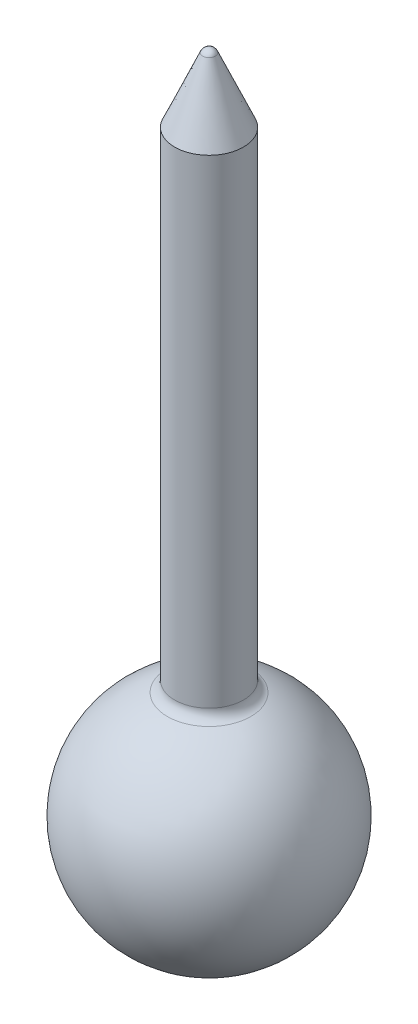
ISO-10303-21;
HEADER;
FILE_DESCRIPTION(('STEP AP214'),'2;1');
FILE_NAME('part.step','',(''),(''),'','','');
FILE_SCHEMA(('AUTOMOTIVE_DESIGN { 1 0 10303 214 1 1 1 1 }'));
ENDSEC;
DATA;
#1=APPLICATION_CONTEXT('core data for automotive mechanical design processes');
#2=APPLICATION_PROTOCOL_DEFINITION('international standard','automotive_design',2000,#1);
#3=PRODUCT_CONTEXT('',#1,'mechanical');
#4=PRODUCT('Part','Part','',(#3));
#5=PRODUCT_RELATED_PRODUCT_CATEGORY('part','',(#4));
#6=PRODUCT_DEFINITION_FORMATION('','',#4);
#7=PRODUCT_DEFINITION_CONTEXT('part definition',#1,'design');
#8=PRODUCT_DEFINITION('design','',#6,#7);
#9=PRODUCT_DEFINITION_SHAPE('','',#8);
#10=(LENGTH_UNIT() NAMED_UNIT(*) SI_UNIT(.MILLI.,.METRE.));
#11=(NAMED_UNIT(*) PLANE_ANGLE_UNIT() SI_UNIT($,.RADIAN.));
#12=(NAMED_UNIT(*) SI_UNIT($,.STERADIAN.) SOLID_ANGLE_UNIT());
#13=UNCERTAINTY_MEASURE_WITH_UNIT(LENGTH_MEASURE(1.E-05),#10,'distance_accuracy_value','');
#14=(GEOMETRIC_REPRESENTATION_CONTEXT(3) GLOBAL_UNCERTAINTY_ASSIGNED_CONTEXT((#13)) GLOBAL_UNIT_ASSIGNED_CONTEXT((#10,
#11,#12)) REPRESENTATION_CONTEXT('',''));
#15=CARTESIAN_POINT('',(0.,0.,0.));
#16=DIRECTION('',(0.,0.,1.));
#17=DIRECTION('',(1.,0.,0.));
#18=AXIS2_PLACEMENT_3D('',#15,#16,#17);
#19=CARTESIAN_POINT('',(0.,5.,0.));
#20=DIRECTION('',(0.,-1.,0.));
#21=DIRECTION('',(-1.,0.,0.));
#22=AXIS2_PLACEMENT_3D('',#19,#20,#21);
#23=SPHERICAL_SURFACE('',#22,5.);
#24=CARTESIAN_POINT('',(0.,9.657704893618,0.));
#25=DIRECTION('',(0.,-1.,0.));
#26=DIRECTION('',(0.,0.,-1.));
#27=AXIS2_PLACEMENT_3D('',#24,#25,#26);
#28=CIRCLE('',#27,1.81818181818182);
#29=CARTESIAN_POINT('',(0.,9.657704893618,-1.81818181818182));
#30=VERTEX_POINT('',#29);
#31=EDGE_CURVE('E56',#30,#30,#28,.T.);
#32=ORIENTED_EDGE('',*,*,#31,.T.);
#33=EDGE_LOOP('',(#32));
#34=FACE_BOUND('',#33,.T.);
#35=ADVANCED_FACE('F30',(#34),#23,.T.);
#36=CARTESIAN_POINT('',(0.,33.7,0.));
#37=DIRECTION('',(0.,-1.,0.));
#38=DIRECTION('',(1.,0.,0.));
#39=AXIS2_PLACEMENT_3D('',#36,#37,#38);
#40=SPHERICAL_SURFACE('',#39,0.300000000000001);
#41=CARTESIAN_POINT('',(0.,33.8195323221598,0.));
#42=DIRECTION('',(0.,-1.,0.));
#43=DIRECTION('',(0.,0.,-1.));
#44=AXIS2_PLACEMENT_3D('',#41,#42,#43);
#45=CIRCLE('',#44,0.275158179887652);
#46=CARTESIAN_POINT('',(0.,33.8195323221598,-0.275158179887652));
#47=VERTEX_POINT('',#46);
#48=EDGE_CURVE('E45',#47,#47,#45,.T.);
#49=ORIENTED_EDGE('',*,*,#48,.F.);
#50=EDGE_LOOP('',(#49));
#51=FACE_BOUND('',#50,.T.);
#52=ADVANCED_FACE('F74',(#51),#40,.T.);
#53=CARTESIAN_POINT('',(0.,31.,0.));
#54=DIRECTION('',(0.,-1.,0.));
#55=DIRECTION('',(0.,0.,-1.));
#56=AXIS2_PLACEMENT_3D('',#53,#54,#55);
#57=CONICAL_SURFACE('',#56,1.5,0.409816548258795);
#58=ORIENTED_EDGE('',*,*,#48,.T.);
#59=EDGE_LOOP('',(#58));
#60=FACE_BOUND('',#59,.T.);
#61=CARTESIAN_POINT('',(0.,31.,0.));
#62=DIRECTION('',(0.,-1.,0.));
#63=DIRECTION('',(0.,0.,-1.));
#64=AXIS2_PLACEMENT_3D('',#61,#62,#63);
#65=CIRCLE('',#64,1.5);
#66=CARTESIAN_POINT('',(0.,31.,-1.5));
#67=VERTEX_POINT('',#66);
#68=EDGE_CURVE('E50',#67,#67,#65,.T.);
#69=ORIENTED_EDGE('',*,*,#68,.F.);
#70=EDGE_LOOP('',(#69));
#71=FACE_BOUND('',#70,.T.);
#72=ADVANCED_FACE('F70',(#60,#71),#57,.T.);
#73=CARTESIAN_POINT('',(0.,0.,0.));
#74=DIRECTION('',(0.,-1.,0.));
#75=DIRECTION('',(0.,0.,-1.));
#76=AXIS2_PLACEMENT_3D('',#73,#74,#75);
#77=CYLINDRICAL_SURFACE('',#76,1.5);
#78=ORIENTED_EDGE('',*,*,#68,.T.);
#79=EDGE_LOOP('',(#78));
#80=FACE_BOUND('',#79,.T.);
#81=CARTESIAN_POINT('',(0.,10.1234753829798,0.));
#82=DIRECTION('',(0.,-1.,0.));
#83=DIRECTION('',(0.,0.,-1.));
#84=AXIS2_PLACEMENT_3D('',#81,#82,#83);
#85=CIRCLE('',#84,1.5);
#86=CARTESIAN_POINT('',(0.,10.1234753829798,-1.5));
#87=VERTEX_POINT('',#86);
#88=EDGE_CURVE('E53',#87,#87,#85,.T.);
#89=ORIENTED_EDGE('',*,*,#88,.F.);
#90=EDGE_LOOP('',(#89));
#91=FACE_BOUND('',#90,.T.);
#92=ADVANCED_FACE('F63',(#80,#91),#77,.T.);
#93=CARTESIAN_POINT('',(0.,10.1234753829798,0.));
#94=DIRECTION('',(0.,-1.,0.));
#95=DIRECTION('',(0.,0.,-1.));
#96=AXIS2_PLACEMENT_3D('',#93,#94,#95);
#97=TOROIDAL_SURFACE('',#96,2.,0.499999999999999);
#98=ORIENTED_EDGE('',*,*,#88,.T.);
#99=EDGE_LOOP('',(#98));
#100=FACE_BOUND('',#99,.T.);
#101=ORIENTED_EDGE('',*,*,#31,.F.);
#102=EDGE_LOOP('',(#101));
#103=FACE_BOUND('',#102,.T.);
#104=ADVANCED_FACE('F61',(#100,#103),#97,.F.);
#105=CLOSED_SHELL('',(#35,#52,#72,#92,#104));
#106=CARTESIAN_POINT('',(0.,5.,0.));
#107=DIRECTION('',(0.,-1.,0.));
#108=DIRECTION('',(1.,0.,0.));
#109=AXIS2_PLACEMENT_3D('',#106,#107,#108);
#110=SPHERICAL_SURFACE('',#109,4.75);
#111=CARTESIAN_POINT('',(0.,9.66303612421045,0.));
#112=DIRECTION('',(0.,-1.,0.));
#113=DIRECTION('',(0.,0.,-1.));
#114=AXIS2_PLACEMENT_3D('',#111,#112,#113);
#115=CIRCLE('',#114,0.904761904761907);
#116=CARTESIAN_POINT('',(0.,9.66303612421045,-0.904761904761907));
#117=VERTEX_POINT('',#116);
#118=EDGE_CURVE('E10',#117,#117,#115,.T.);
#119=ORIENTED_EDGE('',*,*,#118,.F.);
#120=EDGE_LOOP('',(#119));
#121=FACE_BOUND('',#120,.T.);
#122=ADVANCED_FACE('F97',(#121),#110,.F.);
#123=CARTESIAN_POINT('',(0.,10.1538820320221,0.));
#124=DIRECTION('',(0.,-1.,0.));
#125=DIRECTION('',(0.,0.,-1.));
#126=AXIS2_PLACEMENT_3D('',#123,#124,#125);
#127=TOROIDAL_SURFACE('',#126,1.,0.5);
#128=ORIENTED_EDGE('',*,*,#118,.T.);
#129=EDGE_LOOP('',(#128));
#130=FACE_BOUND('',#129,.T.);
#131=CARTESIAN_POINT('',(0.,10.1538820320221,0.));
#132=DIRECTION('',(0.,-1.,0.));
#133=DIRECTION('',(0.,0.,-1.));
#134=AXIS2_PLACEMENT_3D('',#131,#132,#133);
#135=CIRCLE('',#134,0.500000000000002);
#136=CARTESIAN_POINT('',(0.,10.1538820320221,-0.500000000000002));
#137=VERTEX_POINT('',#136);
#138=EDGE_CURVE('E37',#137,#137,#135,.T.);
#139=ORIENTED_EDGE('',*,*,#138,.F.);
#140=EDGE_LOOP('',(#139));
#141=FACE_BOUND('',#140,.T.);
#142=ADVANCED_FACE('F95',(#130,#141),#127,.T.);
#143=CARTESIAN_POINT('',(0.,0.,0.));
#144=DIRECTION('',(0.,-1.,0.));
#145=DIRECTION('',(0.,0.,-1.));
#146=AXIS2_PLACEMENT_3D('',#143,#144,#145);
#147=CYLINDRICAL_SURFACE('',#146,0.500000000000001);
#148=ORIENTED_EDGE('',*,*,#138,.T.);
#149=EDGE_LOOP('',(#148));
#150=FACE_BOUND('',#149,.T.);
#151=CARTESIAN_POINT('',(0.,31.5,0.));
#152=DIRECTION('',(0.,-1.,0.));
#153=DIRECTION('',(0.,0.,-1.));
#154=AXIS2_PLACEMENT_3D('',#151,#152,#153);
#155=CIRCLE('',#154,0.5);
#156=CARTESIAN_POINT('',(0.,31.5,-0.5));
#157=VERTEX_POINT('',#156);
#158=EDGE_CURVE('E41',#157,#157,#155,.T.);
#159=ORIENTED_EDGE('',*,*,#158,.F.);
#160=EDGE_LOOP('',(#159));
#161=FACE_BOUND('',#160,.T.);
#162=ADVANCED_FACE('F90',(#150,#161),#147,.F.);
#163=CARTESIAN_POINT('',(0.,31.5,0.));
#164=DIRECTION('',(0.,-1.,0.));
#165=DIRECTION('',(1.,0.,0.));
#166=AXIS2_PLACEMENT_3D('',#163,#164,#165);
#167=SPHERICAL_SURFACE('',#166,0.5);
#168=ORIENTED_EDGE('',*,*,#158,.T.);
#169=EDGE_LOOP('',(#168));
#170=FACE_BOUND('',#169,.T.);
#171=ADVANCED_FACE('F87',(#170),#167,.F.);
#172=CLOSED_SHELL('',(#122,#142,#162,#171));
#173=ORIENTED_CLOSED_SHELL('',*,#172,.T.);
#174=BREP_WITH_VOIDS('B2',#105,(#173));
#175=ADVANCED_BREP_SHAPE_REPRESENTATION('',(#18,#174),#14);
#176=SHAPE_DEFINITION_REPRESENTATION(#9,#175);
ENDSEC;
END-ISO-10303-21;
